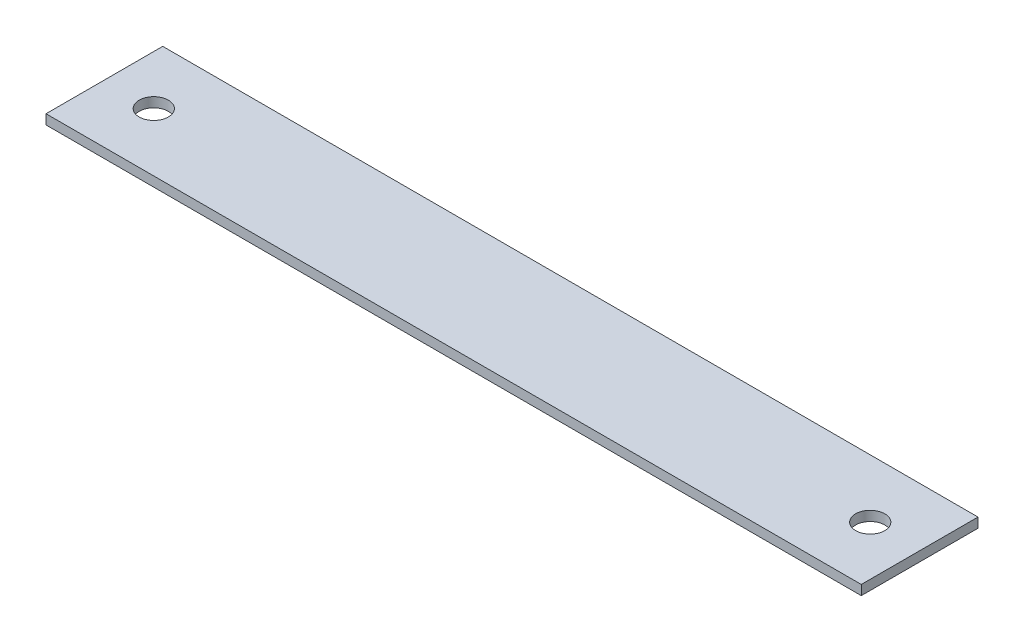
ISO-10303-21;
HEADER;
FILE_DESCRIPTION(('STEP AP214'),'2;1');
FILE_NAME('part.step','',(''),(''),'','','');
FILE_SCHEMA(('AUTOMOTIVE_DESIGN { 1 0 10303 214 1 1 1 1 }'));
ENDSEC;
DATA;
#1=APPLICATION_CONTEXT('core data for automotive mechanical design processes');
#2=APPLICATION_PROTOCOL_DEFINITION('international standard','automotive_design',2000,#1);
#3=PRODUCT_CONTEXT('',#1,'mechanical');
#4=PRODUCT('Part','Part','',(#3));
#5=PRODUCT_RELATED_PRODUCT_CATEGORY('part','',(#4));
#6=PRODUCT_DEFINITION_FORMATION('','',#4);
#7=PRODUCT_DEFINITION_CONTEXT('part definition',#1,'design');
#8=PRODUCT_DEFINITION('design','',#6,#7);
#9=PRODUCT_DEFINITION_SHAPE('','',#8);
#10=(LENGTH_UNIT() NAMED_UNIT(*) SI_UNIT(.MILLI.,.METRE.));
#11=(NAMED_UNIT(*) PLANE_ANGLE_UNIT() SI_UNIT($,.RADIAN.));
#12=(NAMED_UNIT(*) SI_UNIT($,.STERADIAN.) SOLID_ANGLE_UNIT());
#13=UNCERTAINTY_MEASURE_WITH_UNIT(LENGTH_MEASURE(1.E-05),#10,'distance_accuracy_value','');
#14=(GEOMETRIC_REPRESENTATION_CONTEXT(3) GLOBAL_UNCERTAINTY_ASSIGNED_CONTEXT((#13)) GLOBAL_UNIT_ASSIGNED_CONTEXT((#10,
#11,#12)) REPRESENTATION_CONTEXT('',''));
#15=CARTESIAN_POINT('',(0.,0.,0.));
#16=DIRECTION('',(0.,0.,1.));
#17=DIRECTION('',(1.,0.,0.));
#18=AXIS2_PLACEMENT_3D('',#15,#16,#17);
#19=CARTESIAN_POINT('',(0.,5.,0.));
#20=DIRECTION('',(0.,0.,-1.));
#21=DIRECTION('',(-1.,0.,0.));
#22=AXIS2_PLACEMENT_3D('',#19,#20,#21);
#23=PLANE('',#22);
#24=DIRECTION('',(1.,0.,0.));
#25=VECTOR('',#24,1.);
#26=CARTESIAN_POINT('',(0.,0.,0.));
#27=LINE('',#26,#25);
#28=CARTESIAN_POINT('',(0.,0.,0.));
#29=VERTEX_POINT('',#28);
#30=CARTESIAN_POINT('',(419.1,0.,0.));
#31=VERTEX_POINT('',#30);
#32=EDGE_CURVE('E105',#29,#31,#27,.T.);
#33=ORIENTED_EDGE('',*,*,#32,.T.);
#34=DIRECTION('',(0.,-1.,0.));
#35=VECTOR('',#34,1.);
#36=CARTESIAN_POINT('',(419.1,5.,0.));
#37=LINE('',#36,#35);
#38=CARTESIAN_POINT('',(419.1,5.,0.));
#39=VERTEX_POINT('',#38);
#40=EDGE_CURVE('E11',#39,#31,#37,.T.);
#41=ORIENTED_EDGE('',*,*,#40,.F.);
#42=DIRECTION('',(1.,0.,0.));
#43=VECTOR('',#42,1.);
#44=CARTESIAN_POINT('',(0.,5.,0.));
#45=LINE('',#44,#43);
#46=CARTESIAN_POINT('',(0.,5.,0.));
#47=VERTEX_POINT('',#46);
#48=EDGE_CURVE('E85',#47,#39,#45,.T.);
#49=ORIENTED_EDGE('',*,*,#48,.F.);
#50=DIRECTION('',(0.,-1.,0.));
#51=VECTOR('',#50,1.);
#52=CARTESIAN_POINT('',(0.,5.,0.));
#53=LINE('',#52,#51);
#54=EDGE_CURVE('E52',#47,#29,#53,.T.);
#55=ORIENTED_EDGE('',*,*,#54,.T.);
#56=EDGE_LOOP('',(#33,#41,#49,#55));
#57=FACE_BOUND('',#56,.T.);
#58=ADVANCED_FACE('F35',(#57),#23,.F.);
#59=CARTESIAN_POINT('',(419.1,5.,0.));
#60=DIRECTION('',(-1.,0.,0.));
#61=DIRECTION('',(0.,0.,1.));
#62=AXIS2_PLACEMENT_3D('',#59,#60,#61);
#63=PLANE('',#62);
#64=DIRECTION('',(0.,0.,-1.));
#65=VECTOR('',#64,1.);
#66=CARTESIAN_POINT('',(419.1,0.,0.));
#67=LINE('',#66,#65);
#68=CARTESIAN_POINT('',(419.1,0.,-60.));
#69=VERTEX_POINT('',#68);
#70=EDGE_CURVE('E90',#31,#69,#67,.T.);
#71=ORIENTED_EDGE('',*,*,#70,.T.);
#72=DIRECTION('',(0.,-1.,0.));
#73=VECTOR('',#72,1.);
#74=CARTESIAN_POINT('',(419.1,5.,-60.));
#75=LINE('',#74,#73);
#76=CARTESIAN_POINT('',(419.1,5.,-60.));
#77=VERTEX_POINT('',#76);
#78=EDGE_CURVE('E44',#77,#69,#75,.T.);
#79=ORIENTED_EDGE('',*,*,#78,.F.);
#80=DIRECTION('',(0.,0.,-1.));
#81=VECTOR('',#80,1.);
#82=CARTESIAN_POINT('',(419.1,5.,0.));
#83=LINE('',#82,#81);
#84=EDGE_CURVE('E77',#39,#77,#83,.T.);
#85=ORIENTED_EDGE('',*,*,#84,.F.);
#86=ORIENTED_EDGE('',*,*,#40,.T.);
#87=EDGE_LOOP('',(#71,#79,#85,#86));
#88=FACE_BOUND('',#87,.T.);
#89=ADVANCED_FACE('F89',(#88),#63,.F.);
#90=CARTESIAN_POINT('',(0.,5.,-60.));
#91=DIRECTION('',(0.,0.,-1.));
#92=DIRECTION('',(-1.,0.,0.));
#93=AXIS2_PLACEMENT_3D('',#90,#91,#92);
#94=PLANE('',#93);
#95=DIRECTION('',(1.,0.,0.));
#96=VECTOR('',#95,1.);
#97=CARTESIAN_POINT('',(0.,0.,-60.));
#98=LINE('',#97,#96);
#99=CARTESIAN_POINT('',(-1.11022302462516E-13,0.,-60.));
#100=VERTEX_POINT('',#99);
#101=EDGE_CURVE('E108',#100,#69,#98,.T.);
#102=ORIENTED_EDGE('',*,*,#101,.F.);
#103=DIRECTION('',(0.,-1.,0.));
#104=VECTOR('',#103,1.);
#105=CARTESIAN_POINT('',(-1.11022302462516E-13,5.,-60.));
#106=LINE('',#105,#104);
#107=CARTESIAN_POINT('',(-1.11022302462516E-13,5.,-60.));
#108=VERTEX_POINT('',#107);
#109=EDGE_CURVE('E66',#108,#100,#106,.T.);
#110=ORIENTED_EDGE('',*,*,#109,.F.);
#111=DIRECTION('',(1.,0.,0.));
#112=VECTOR('',#111,1.);
#113=CARTESIAN_POINT('',(0.,5.,-60.));
#114=LINE('',#113,#112);
#115=EDGE_CURVE('E84',#108,#77,#114,.T.);
#116=ORIENTED_EDGE('',*,*,#115,.T.);
#117=ORIENTED_EDGE('',*,*,#78,.T.);
#118=EDGE_LOOP('',(#102,#110,#116,#117));
#119=FACE_BOUND('',#118,.T.);
#120=ADVANCED_FACE('F93',(#119),#94,.T.);
#121=CARTESIAN_POINT('',(25.4,5.,-30.));
#122=DIRECTION('',(0.,-1.,0.));
#123=DIRECTION('',(0.,0.,-1.));
#124=AXIS2_PLACEMENT_3D('',#121,#122,#123);
#125=CYLINDRICAL_SURFACE('',#124,7.5);
#126=CARTESIAN_POINT('',(25.4,5.,-30.));
#127=DIRECTION('',(0.,1.,0.));
#128=DIRECTION('',(0.,0.,1.));
#129=AXIS2_PLACEMENT_3D('',#126,#127,#128);
#130=CIRCLE('',#129,7.5);
#131=CARTESIAN_POINT('',(25.4,5.,-22.5));
#132=VERTEX_POINT('',#131);
#133=EDGE_CURVE('E117',#132,#132,#130,.T.);
#134=ORIENTED_EDGE('',*,*,#133,.T.);
#135=EDGE_LOOP('',(#134));
#136=FACE_BOUND('',#135,.T.);
#137=CARTESIAN_POINT('',(25.4,0.,-30.));
#138=DIRECTION('',(0.,1.,0.));
#139=DIRECTION('',(0.,0.,1.));
#140=AXIS2_PLACEMENT_3D('',#137,#138,#139);
#141=CIRCLE('',#140,7.5);
#142=CARTESIAN_POINT('',(25.4,0.,-22.5));
#143=VERTEX_POINT('',#142);
#144=EDGE_CURVE('E102',#143,#143,#141,.T.);
#145=ORIENTED_EDGE('',*,*,#144,.F.);
#146=EDGE_LOOP('',(#145));
#147=FACE_BOUND('',#146,.T.);
#148=ADVANCED_FACE('F125',(#136,#147),#125,.F.);
#149=CARTESIAN_POINT('',(393.7,5.,-30.));
#150=DIRECTION('',(0.,-1.,0.));
#151=DIRECTION('',(0.,0.,-1.));
#152=AXIS2_PLACEMENT_3D('',#149,#150,#151);
#153=CYLINDRICAL_SURFACE('',#152,7.49999999999995);
#154=CARTESIAN_POINT('',(393.7,5.,-30.));
#155=DIRECTION('',(0.,1.,0.));
#156=DIRECTION('',(0.,0.,1.));
#157=AXIS2_PLACEMENT_3D('',#154,#155,#156);
#158=CIRCLE('',#157,7.49999999999995);
#159=CARTESIAN_POINT('',(393.7,5.,-22.5));
#160=VERTEX_POINT('',#159);
#161=EDGE_CURVE('E113',#160,#160,#158,.T.);
#162=ORIENTED_EDGE('',*,*,#161,.T.);
#163=EDGE_LOOP('',(#162));
#164=FACE_BOUND('',#163,.T.);
#165=CARTESIAN_POINT('',(393.7,0.,-30.));
#166=DIRECTION('',(0.,1.,0.));
#167=DIRECTION('',(0.,0.,1.));
#168=AXIS2_PLACEMENT_3D('',#165,#166,#167);
#169=CIRCLE('',#168,7.49999999999995);
#170=CARTESIAN_POINT('',(393.7,0.,-22.5));
#171=VERTEX_POINT('',#170);
#172=EDGE_CURVE('E99',#171,#171,#169,.T.);
#173=ORIENTED_EDGE('',*,*,#172,.F.);
#174=EDGE_LOOP('',(#173));
#175=FACE_BOUND('',#174,.T.);
#176=ADVANCED_FACE('F37',(#164,#175),#153,.F.);
#177=CARTESIAN_POINT('',(0.,5.,0.));
#178=DIRECTION('',(-1.,0.,0.));
#179=DIRECTION('',(0.,0.,1.));
#180=AXIS2_PLACEMENT_3D('',#177,#178,#179);
#181=PLANE('',#180);
#182=DIRECTION('',(0.,0.,-1.));
#183=VECTOR('',#182,1.);
#184=CARTESIAN_POINT('',(0.,0.,0.));
#185=LINE('',#184,#183);
#186=EDGE_CURVE('E110',#29,#100,#185,.T.);
#187=ORIENTED_EDGE('',*,*,#186,.F.);
#188=ORIENTED_EDGE('',*,*,#54,.F.);
#189=DIRECTION('',(0.,0.,-1.));
#190=VECTOR('',#189,1.);
#191=CARTESIAN_POINT('',(0.,5.,0.));
#192=LINE('',#191,#190);
#193=EDGE_CURVE('E94',#47,#108,#192,.T.);
#194=ORIENTED_EDGE('',*,*,#193,.T.);
#195=ORIENTED_EDGE('',*,*,#109,.T.);
#196=EDGE_LOOP('',(#187,#188,#194,#195));
#197=FACE_BOUND('',#196,.T.);
#198=ADVANCED_FACE('F130',(#197),#181,.T.);
#199=CARTESIAN_POINT('',(0.,5.,0.));
#200=DIRECTION('',(0.,1.,0.));
#201=DIRECTION('',(0.,0.,1.));
#202=AXIS2_PLACEMENT_3D('',#199,#200,#201);
#203=PLANE('',#202);
#204=ORIENTED_EDGE('',*,*,#161,.F.);
#205=EDGE_LOOP('',(#204));
#206=FACE_BOUND('',#205,.T.);
#207=ORIENTED_EDGE('',*,*,#133,.F.);
#208=EDGE_LOOP('',(#207));
#209=FACE_BOUND('',#208,.T.);
#210=ORIENTED_EDGE('',*,*,#48,.T.);
#211=ORIENTED_EDGE('',*,*,#84,.T.);
#212=ORIENTED_EDGE('',*,*,#115,.F.);
#213=ORIENTED_EDGE('',*,*,#193,.F.);
#214=EDGE_LOOP('',(#210,#211,#212,#213));
#215=FACE_BOUND('',#214,.T.);
#216=ADVANCED_FACE('F81',(#206,#209,#215),#203,.T.);
#217=CARTESIAN_POINT('',(0.,0.,0.));
#218=DIRECTION('',(0.,1.,0.));
#219=DIRECTION('',(0.,0.,1.));
#220=AXIS2_PLACEMENT_3D('',#217,#218,#219);
#221=PLANE('',#220);
#222=ORIENTED_EDGE('',*,*,#172,.T.);
#223=EDGE_LOOP('',(#222));
#224=FACE_BOUND('',#223,.T.);
#225=ORIENTED_EDGE('',*,*,#144,.T.);
#226=EDGE_LOOP('',(#225));
#227=FACE_BOUND('',#226,.T.);
#228=ORIENTED_EDGE('',*,*,#32,.F.);
#229=ORIENTED_EDGE('',*,*,#186,.T.);
#230=ORIENTED_EDGE('',*,*,#101,.T.);
#231=ORIENTED_EDGE('',*,*,#70,.F.);
#232=EDGE_LOOP('',(#228,#229,#230,#231));
#233=FACE_BOUND('',#232,.T.);
#234=ADVANCED_FACE('F129',(#224,#227,#233),#221,.F.);
#235=CLOSED_SHELL('',(#58,#89,#120,#148,#176,#198,#216,#234));
#236=MANIFOLD_SOLID_BREP('B2',#235);
#237=ADVANCED_BREP_SHAPE_REPRESENTATION('',(#18,#236),#14);
#238=SHAPE_DEFINITION_REPRESENTATION(#9,#237);
ENDSEC;
END-ISO-10303-21;
